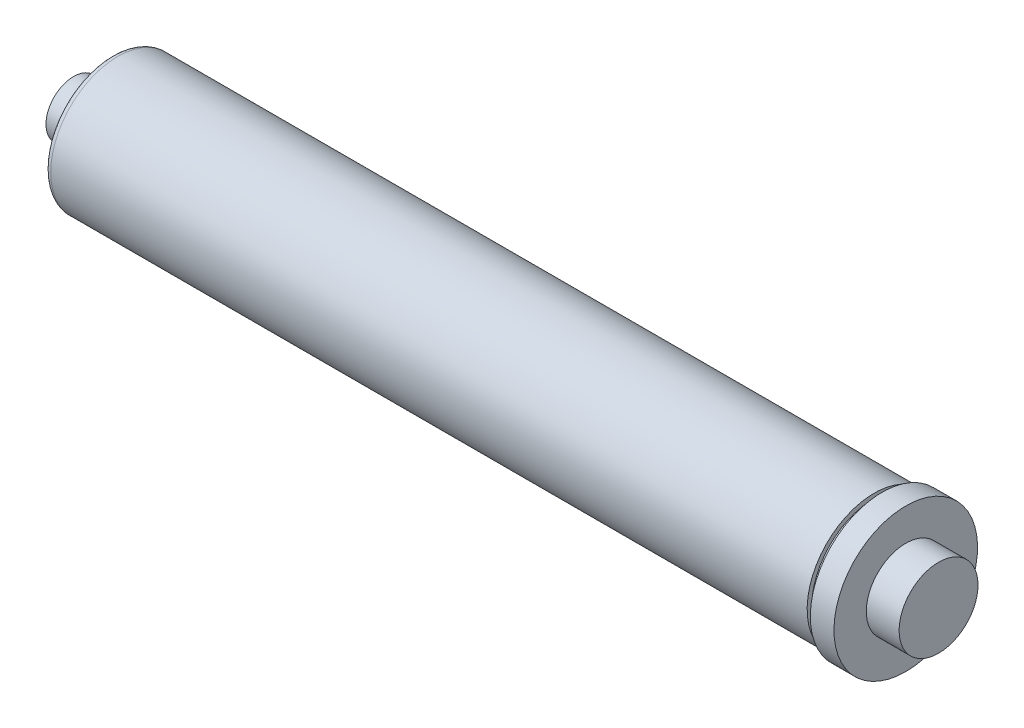
ISO-10303-21;
HEADER;
FILE_DESCRIPTION(('STEP AP214'),'2;1');
FILE_NAME('part.step','',(''),(''),'','','');
FILE_SCHEMA(('AUTOMOTIVE_DESIGN { 1 0 10303 214 1 1 1 1 }'));
ENDSEC;
DATA;
#1=APPLICATION_CONTEXT('core data for automotive mechanical design processes');
#2=APPLICATION_PROTOCOL_DEFINITION('international standard','automotive_design',2000,#1);
#3=PRODUCT_CONTEXT('',#1,'mechanical');
#4=PRODUCT('Part','Part','',(#3));
#5=PRODUCT_RELATED_PRODUCT_CATEGORY('part','',(#4));
#6=PRODUCT_DEFINITION_FORMATION('','',#4);
#7=PRODUCT_DEFINITION_CONTEXT('part definition',#1,'design');
#8=PRODUCT_DEFINITION('design','',#6,#7);
#9=PRODUCT_DEFINITION_SHAPE('','',#8);
#10=(LENGTH_UNIT() NAMED_UNIT(*) SI_UNIT(.MILLI.,.METRE.));
#11=(NAMED_UNIT(*) PLANE_ANGLE_UNIT() SI_UNIT($,.RADIAN.));
#12=(NAMED_UNIT(*) SI_UNIT($,.STERADIAN.) SOLID_ANGLE_UNIT());
#13=UNCERTAINTY_MEASURE_WITH_UNIT(LENGTH_MEASURE(1.E-05),#10,'distance_accuracy_value','');
#14=(GEOMETRIC_REPRESENTATION_CONTEXT(3) GLOBAL_UNCERTAINTY_ASSIGNED_CONTEXT((#13)) GLOBAL_UNIT_ASSIGNED_CONTEXT((#10,
#11,#12)) REPRESENTATION_CONTEXT('',''));
#15=CARTESIAN_POINT('',(0.,0.,0.));
#16=DIRECTION('',(0.,0.,1.));
#17=DIRECTION('',(1.,0.,0.));
#18=AXIS2_PLACEMENT_3D('',#15,#16,#17);
#19=CARTESIAN_POINT('',(0.,0.,0.));
#20=DIRECTION('',(1.,0.,0.));
#21=DIRECTION('',(0.,1.,0.));
#22=AXIS2_PLACEMENT_3D('',#19,#20,#21);
#23=PLANE('',#22);
#24=CARTESIAN_POINT('',(0.,0.,0.));
#25=DIRECTION('',(-1.,0.,0.));
#26=DIRECTION('',(0.,-1.,0.));
#27=AXIS2_PLACEMENT_3D('',#24,#25,#26);
#28=CIRCLE('',#27,7.62);
#29=CARTESIAN_POINT('',(0.,-7.62,0.));
#30=VERTEX_POINT('',#29);
#31=EDGE_CURVE('E93',#30,#30,#28,.T.);
#32=ORIENTED_EDGE('',*,*,#31,.F.);
#33=EDGE_LOOP('',(#32));
#34=FACE_BOUND('',#33,.T.);
#35=CARTESIAN_POINT('',(0.,0.,0.));
#36=DIRECTION('',(-1.,0.,0.));
#37=DIRECTION('',(0.,-1.,0.));
#38=AXIS2_PLACEMENT_3D('',#35,#36,#37);
#39=CIRCLE('',#38,11.1125);
#40=CARTESIAN_POINT('',(0.,-11.1125,0.));
#41=VERTEX_POINT('',#40);
#42=EDGE_CURVE('E53',#41,#41,#39,.T.);
#43=ORIENTED_EDGE('',*,*,#42,.T.);
#44=EDGE_LOOP('',(#43));
#45=FACE_BOUND('',#44,.T.);
#46=ADVANCED_FACE('F40',(#34,#45),#23,.F.);
#47=CARTESIAN_POINT('',(0.,0.,0.));
#48=DIRECTION('',(-1.,0.,0.));
#49=DIRECTION('',(0.,-1.,0.));
#50=AXIS2_PLACEMENT_3D('',#47,#48,#49);
#51=CYLINDRICAL_SURFACE('',#50,11.1125);
#52=ORIENTED_EDGE('',*,*,#42,.F.);
#53=EDGE_LOOP('',(#52));
#54=FACE_BOUND('',#53,.T.);
#55=CARTESIAN_POINT('',(15.24,0.,0.));
#56=DIRECTION('',(-1.,0.,0.));
#57=DIRECTION('',(0.,-1.,0.));
#58=AXIS2_PLACEMENT_3D('',#55,#56,#57);
#59=CIRCLE('',#58,11.1125);
#60=CARTESIAN_POINT('',(15.24,-11.1125,0.));
#61=VERTEX_POINT('',#60);
#62=EDGE_CURVE('E58',#61,#61,#59,.T.);
#63=ORIENTED_EDGE('',*,*,#62,.T.);
#64=EDGE_LOOP('',(#63));
#65=FACE_BOUND('',#64,.T.);
#66=ADVANCED_FACE('F131',(#54,#65),#51,.T.);
#67=CARTESIAN_POINT('',(15.24,11.1125,0.));
#68=DIRECTION('',(1.,0.,0.));
#69=DIRECTION('',(0.,1.,0.));
#70=AXIS2_PLACEMENT_3D('',#67,#68,#69);
#71=PLANE('',#70);
#72=CARTESIAN_POINT('',(15.24,0.,0.));
#73=DIRECTION('',(1.,0.,0.));
#74=DIRECTION('',(0.,1.,0.));
#75=AXIS2_PLACEMENT_3D('',#72,#73,#74);
#76=CIRCLE('',#75,24.4475);
#77=CARTESIAN_POINT('',(15.24,24.4475,0.));
#78=VERTEX_POINT('',#77);
#79=EDGE_CURVE('E48',#78,#78,#76,.F.);
#80=ORIENTED_EDGE('',*,*,#79,.T.);
#81=EDGE_LOOP('',(#80));
#82=FACE_BOUND('',#81,.T.);
#83=ORIENTED_EDGE('',*,*,#62,.F.);
#84=EDGE_LOOP('',(#83));
#85=FACE_BOUND('',#84,.T.);
#86=ADVANCED_FACE('F136',(#82,#85),#71,.F.);
#87=CARTESIAN_POINT('',(0.,0.,0.));
#88=DIRECTION('',(-1.,0.,0.));
#89=DIRECTION('',(0.,-1.,0.));
#90=AXIS2_PLACEMENT_3D('',#87,#88,#89);
#91=CYLINDRICAL_SURFACE('',#90,26.9875);
#92=CARTESIAN_POINT('',(17.78,0.,0.));
#93=DIRECTION('',(1.,0.,0.));
#94=DIRECTION('',(0.,1.,0.));
#95=AXIS2_PLACEMENT_3D('',#92,#93,#94);
#96=CIRCLE('',#95,26.9875);
#97=CARTESIAN_POINT('',(17.78,26.9875,0.));
#98=VERTEX_POINT('',#97);
#99=EDGE_CURVE('E10',#98,#98,#96,.T.);
#100=ORIENTED_EDGE('',*,*,#99,.T.);
#101=EDGE_LOOP('',(#100));
#102=FACE_BOUND('',#101,.T.);
#103=CARTESIAN_POINT('',(322.199,0.,0.));
#104=DIRECTION('',(-1.,0.,0.));
#105=DIRECTION('',(0.,-1.,0.));
#106=AXIS2_PLACEMENT_3D('',#103,#104,#105);
#107=CIRCLE('',#106,26.9875);
#108=CARTESIAN_POINT('',(322.199,-26.9875,0.));
#109=VERTEX_POINT('',#108);
#110=EDGE_CURVE('E64',#109,#109,#107,.T.);
#111=ORIENTED_EDGE('',*,*,#110,.T.);
#112=EDGE_LOOP('',(#111));
#113=FACE_BOUND('',#112,.T.);
#114=ADVANCED_FACE('F141',(#102,#113),#91,.T.);
#115=CARTESIAN_POINT('',(322.199,26.9875,0.));
#116=DIRECTION('',(-1.,0.,0.));
#117=DIRECTION('',(0.,-1.,0.));
#118=AXIS2_PLACEMENT_3D('',#115,#116,#117);
#119=PLANE('',#118);
#120=ORIENTED_EDGE('',*,*,#110,.F.);
#121=EDGE_LOOP('',(#120));
#122=FACE_BOUND('',#121,.T.);
#123=CARTESIAN_POINT('',(322.199,0.,0.));
#124=DIRECTION('',(-1.,0.,0.));
#125=DIRECTION('',(0.,-1.,0.));
#126=AXIS2_PLACEMENT_3D('',#123,#124,#125);
#127=CIRCLE('',#126,25.1714);
#128=CARTESIAN_POINT('',(322.199,-25.1714,0.));
#129=VERTEX_POINT('',#128);
#130=EDGE_CURVE('E68',#129,#129,#127,.T.);
#131=ORIENTED_EDGE('',*,*,#130,.T.);
#132=EDGE_LOOP('',(#131));
#133=FACE_BOUND('',#132,.T.);
#134=ADVANCED_FACE('F146',(#122,#133),#119,.F.);
#135=CARTESIAN_POINT('',(0.,0.,0.));
#136=DIRECTION('',(-1.,0.,0.));
#137=DIRECTION('',(0.,-1.,0.));
#138=AXIS2_PLACEMENT_3D('',#135,#136,#137);
#139=CYLINDRICAL_SURFACE('',#138,25.1714);
#140=ORIENTED_EDGE('',*,*,#130,.F.);
#141=EDGE_LOOP('',(#140));
#142=FACE_BOUND('',#141,.T.);
#143=CARTESIAN_POINT('',(325.374,0.,0.));
#144=DIRECTION('',(-1.,0.,0.));
#145=DIRECTION('',(0.,-1.,0.));
#146=AXIS2_PLACEMENT_3D('',#143,#144,#145);
#147=CIRCLE('',#146,25.1714);
#148=CARTESIAN_POINT('',(325.374,-25.1714,0.));
#149=VERTEX_POINT('',#148);
#150=EDGE_CURVE('E72',#149,#149,#147,.T.);
#151=ORIENTED_EDGE('',*,*,#150,.T.);
#152=EDGE_LOOP('',(#151));
#153=FACE_BOUND('',#152,.T.);
#154=ADVANCED_FACE('F151',(#142,#153),#139,.T.);
#155=CARTESIAN_POINT('',(325.374,25.1714,0.));
#156=DIRECTION('',(1.,0.,0.));
#157=DIRECTION('',(0.,1.,0.));
#158=AXIS2_PLACEMENT_3D('',#155,#156,#157);
#159=PLANE('',#158);
#160=ORIENTED_EDGE('',*,*,#150,.F.);
#161=EDGE_LOOP('',(#160));
#162=FACE_BOUND('',#161,.T.);
#163=CARTESIAN_POINT('',(325.374,0.,0.));
#164=DIRECTION('',(-1.,0.,0.));
#165=DIRECTION('',(0.,-1.,0.));
#166=AXIS2_PLACEMENT_3D('',#163,#164,#165);
#167=CIRCLE('',#166,28.8925);
#168=CARTESIAN_POINT('',(325.374,-28.8925000000001,0.));
#169=VERTEX_POINT('',#168);
#170=EDGE_CURVE('E76',#169,#169,#167,.T.);
#171=ORIENTED_EDGE('',*,*,#170,.T.);
#172=EDGE_LOOP('',(#171));
#173=FACE_BOUND('',#172,.T.);
#174=ADVANCED_FACE('F155',(#162,#173),#159,.F.);
#175=CARTESIAN_POINT('',(0.,0.,0.));
#176=DIRECTION('',(-1.,0.,0.));
#177=DIRECTION('',(0.,-1.,0.));
#178=AXIS2_PLACEMENT_3D('',#175,#176,#177);
#179=CYLINDRICAL_SURFACE('',#178,28.8925);
#180=ORIENTED_EDGE('',*,*,#170,.F.);
#181=EDGE_LOOP('',(#180));
#182=FACE_BOUND('',#181,.T.);
#183=CARTESIAN_POINT('',(334.899,0.,0.));
#184=DIRECTION('',(-1.,0.,0.));
#185=DIRECTION('',(0.,-1.,0.));
#186=AXIS2_PLACEMENT_3D('',#183,#184,#185);
#187=CIRCLE('',#186,28.8925);
#188=CARTESIAN_POINT('',(334.899,-28.8925000000001,0.));
#189=VERTEX_POINT('',#188);
#190=EDGE_CURVE('E80',#189,#189,#187,.T.);
#191=ORIENTED_EDGE('',*,*,#190,.T.);
#192=EDGE_LOOP('',(#191));
#193=FACE_BOUND('',#192,.T.);
#194=ADVANCED_FACE('F159',(#182,#193),#179,.T.);
#195=CARTESIAN_POINT('',(334.899,28.8925,0.));
#196=DIRECTION('',(-1.,0.,0.));
#197=DIRECTION('',(0.,-1.,0.));
#198=AXIS2_PLACEMENT_3D('',#195,#196,#197);
#199=PLANE('',#198);
#200=ORIENTED_EDGE('',*,*,#190,.F.);
#201=EDGE_LOOP('',(#200));
#202=FACE_BOUND('',#201,.T.);
#203=CARTESIAN_POINT('',(334.899,0.,0.));
#204=DIRECTION('',(-1.,0.,0.));
#205=DIRECTION('',(0.,-1.,0.));
#206=AXIS2_PLACEMENT_3D('',#203,#204,#205);
#207=CIRCLE('',#206,15.875);
#208=CARTESIAN_POINT('',(334.899,-15.875,0.));
#209=VERTEX_POINT('',#208);
#210=EDGE_CURVE('E84',#209,#209,#207,.T.);
#211=ORIENTED_EDGE('',*,*,#210,.T.);
#212=EDGE_LOOP('',(#211));
#213=FACE_BOUND('',#212,.T.);
#214=ADVANCED_FACE('F163',(#202,#213),#199,.F.);
#215=CARTESIAN_POINT('',(0.,0.,0.));
#216=DIRECTION('',(-1.,0.,0.));
#217=DIRECTION('',(0.,-1.,0.));
#218=AXIS2_PLACEMENT_3D('',#215,#216,#217);
#219=CYLINDRICAL_SURFACE('',#218,15.875);
#220=ORIENTED_EDGE('',*,*,#210,.F.);
#221=EDGE_LOOP('',(#220));
#222=FACE_BOUND('',#221,.T.);
#223=CARTESIAN_POINT('',(348.107,0.,0.));
#224=DIRECTION('',(-1.,0.,0.));
#225=DIRECTION('',(0.,-1.,0.));
#226=AXIS2_PLACEMENT_3D('',#223,#224,#225);
#227=CIRCLE('',#226,15.875);
#228=CARTESIAN_POINT('',(348.107,-15.875,0.));
#229=VERTEX_POINT('',#228);
#230=EDGE_CURVE('E88',#229,#229,#227,.T.);
#231=ORIENTED_EDGE('',*,*,#230,.T.);
#232=EDGE_LOOP('',(#231));
#233=FACE_BOUND('',#232,.T.);
#234=ADVANCED_FACE('F167',(#222,#233),#219,.T.);
#235=CARTESIAN_POINT('',(348.107,15.875,0.));
#236=DIRECTION('',(-1.,0.,0.));
#237=DIRECTION('',(0.,-1.,0.));
#238=AXIS2_PLACEMENT_3D('',#235,#236,#237);
#239=PLANE('',#238);
#240=ORIENTED_EDGE('',*,*,#230,.F.);
#241=EDGE_LOOP('',(#240));
#242=FACE_BOUND('',#241,.T.);
#243=ADVANCED_FACE('F171',(#242),#239,.F.);
#244=CARTESIAN_POINT('',(17.78,0.,0.));
#245=DIRECTION('',(1.,0.,0.));
#246=DIRECTION('',(0.,1.,0.));
#247=AXIS2_PLACEMENT_3D('',#244,#245,#246);
#248=TOROIDAL_SURFACE('',#247,24.4475,2.54);
#249=ORIENTED_EDGE('',*,*,#99,.F.);
#250=EDGE_LOOP('',(#249));
#251=FACE_BOUND('',#250,.T.);
#252=ORIENTED_EDGE('',*,*,#79,.F.);
#253=EDGE_LOOP('',(#252));
#254=FACE_BOUND('',#253,.T.);
#255=ADVANCED_FACE('F42',(#251,#254),#248,.T.);
#256=CARTESIAN_POINT('',(6.35,0.,0.));
#257=DIRECTION('',(-1.,0.,0.));
#258=DIRECTION('',(0.,-1.,0.));
#259=AXIS2_PLACEMENT_3D('',#256,#257,#258);
#260=CYLINDRICAL_SURFACE('',#259,7.62);
#261=CARTESIAN_POINT('',(6.35,0.,0.));
#262=DIRECTION('',(-1.,0.,0.));
#263=DIRECTION('',(0.,-1.,0.));
#264=AXIS2_PLACEMENT_3D('',#261,#262,#263);
#265=CIRCLE('',#264,7.62);
#266=CARTESIAN_POINT('',(6.35,-7.62,0.));
#267=VERTEX_POINT('',#266);
#268=EDGE_CURVE('E92',#267,#267,#265,.T.);
#269=ORIENTED_EDGE('',*,*,#268,.F.);
#270=EDGE_LOOP('',(#269));
#271=FACE_BOUND('',#270,.T.);
#272=ORIENTED_EDGE('',*,*,#31,.T.);
#273=EDGE_LOOP('',(#272));
#274=FACE_BOUND('',#273,.T.);
#275=ADVANCED_FACE('F120',(#271,#274),#260,.F.);
#276=CARTESIAN_POINT('',(6.35,0.,0.));
#277=DIRECTION('',(-1.,0.,0.));
#278=DIRECTION('',(0.,-1.,0.));
#279=AXIS2_PLACEMENT_3D('',#276,#277,#278);
#280=PLANE('',#279);
#281=CARTESIAN_POINT('',(6.35,0.,0.));
#282=DIRECTION('',(-1.,0.,0.));
#283=DIRECTION('',(0.,-1.,0.));
#284=AXIS2_PLACEMENT_3D('',#281,#282,#283);
#285=CIRCLE('',#284,1.5875);
#286=CARTESIAN_POINT('',(6.35,-1.5875,0.));
#287=VERTEX_POINT('',#286);
#288=EDGE_CURVE('E101',#287,#287,#285,.T.);
#289=ORIENTED_EDGE('',*,*,#288,.F.);
#290=EDGE_LOOP('',(#289));
#291=FACE_BOUND('',#290,.T.);
#292=ORIENTED_EDGE('',*,*,#268,.T.);
#293=EDGE_LOOP('',(#292));
#294=FACE_BOUND('',#293,.T.);
#295=ADVANCED_FACE('F114',(#291,#294),#280,.T.);
#296=CARTESIAN_POINT('',(12.7,0.,0.));
#297=DIRECTION('',(-1.,0.,0.));
#298=DIRECTION('',(0.,-1.,0.));
#299=AXIS2_PLACEMENT_3D('',#296,#297,#298);
#300=CYLINDRICAL_SURFACE('',#299,1.5875);
#301=CARTESIAN_POINT('',(12.7,0.,0.));
#302=DIRECTION('',(-1.,0.,0.));
#303=DIRECTION('',(0.,-1.,0.));
#304=AXIS2_PLACEMENT_3D('',#301,#302,#303);
#305=CIRCLE('',#304,1.5875);
#306=CARTESIAN_POINT('',(12.7,-1.5875,0.));
#307=VERTEX_POINT('',#306);
#308=EDGE_CURVE('E97',#307,#307,#305,.T.);
#309=ORIENTED_EDGE('',*,*,#308,.F.);
#310=EDGE_LOOP('',(#309));
#311=FACE_BOUND('',#310,.T.);
#312=ORIENTED_EDGE('',*,*,#288,.T.);
#313=EDGE_LOOP('',(#312));
#314=FACE_BOUND('',#313,.T.);
#315=ADVANCED_FACE('F111',(#311,#314),#300,.F.);
#316=CARTESIAN_POINT('',(12.7,0.,0.));
#317=DIRECTION('',(-1.,0.,0.));
#318=DIRECTION('',(0.,-1.,0.));
#319=AXIS2_PLACEMENT_3D('',#316,#317,#318);
#320=PLANE('',#319);
#321=ORIENTED_EDGE('',*,*,#308,.T.);
#322=EDGE_LOOP('',(#321));
#323=FACE_BOUND('',#322,.T.);
#324=ADVANCED_FACE('F109',(#323),#320,.T.);
#325=CLOSED_SHELL('',(#46,#66,#86,#114,#134,#154,#174,#194,#214,#234,#243,#255,#275,#295,#315,#324));
#326=MANIFOLD_SOLID_BREP('B2',#325);
#327=ADVANCED_BREP_SHAPE_REPRESENTATION('',(#18,#326),#14);
#328=SHAPE_DEFINITION_REPRESENTATION(#9,#327);
ENDSEC;
END-ISO-10303-21;
